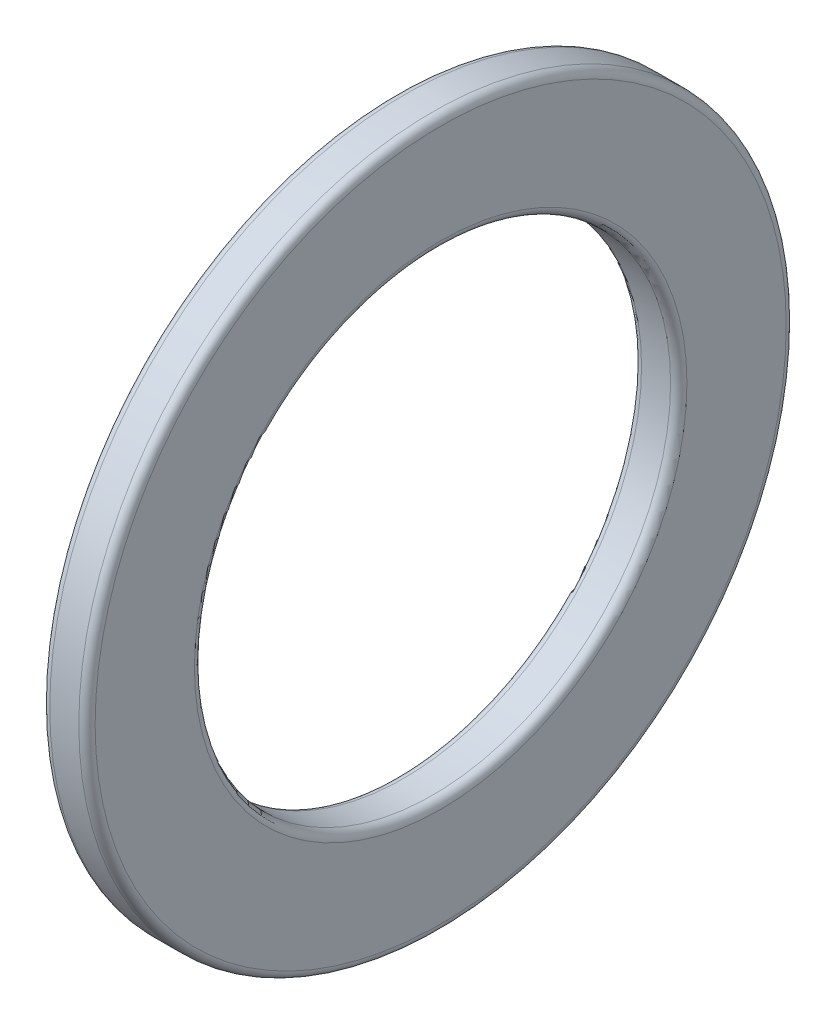
ISO-10303-21;
HEADER;
FILE_DESCRIPTION(('STEP AP214'),'2;1');
FILE_NAME('part.step','',(''),(''),'','','');
FILE_SCHEMA(('AUTOMOTIVE_DESIGN { 1 0 10303 214 1 1 1 1 }'));
ENDSEC;
DATA;
#1=APPLICATION_CONTEXT('core data for automotive mechanical design processes');
#2=APPLICATION_PROTOCOL_DEFINITION('international standard','automotive_design',2000,#1);
#3=PRODUCT_CONTEXT('',#1,'mechanical');
#4=PRODUCT('Part','Part','',(#3));
#5=PRODUCT_RELATED_PRODUCT_CATEGORY('part','',(#4));
#6=PRODUCT_DEFINITION_FORMATION('','',#4);
#7=PRODUCT_DEFINITION_CONTEXT('part definition',#1,'design');
#8=PRODUCT_DEFINITION('design','',#6,#7);
#9=PRODUCT_DEFINITION_SHAPE('','',#8);
#10=(LENGTH_UNIT() NAMED_UNIT(*) SI_UNIT(.MILLI.,.METRE.));
#11=(NAMED_UNIT(*) PLANE_ANGLE_UNIT() SI_UNIT($,.RADIAN.));
#12=(NAMED_UNIT(*) SI_UNIT($,.STERADIAN.) SOLID_ANGLE_UNIT());
#13=UNCERTAINTY_MEASURE_WITH_UNIT(LENGTH_MEASURE(1.E-05),#10,'distance_accuracy_value','');
#14=(GEOMETRIC_REPRESENTATION_CONTEXT(3) GLOBAL_UNCERTAINTY_ASSIGNED_CONTEXT((#13)) GLOBAL_UNIT_ASSIGNED_CONTEXT((#10,
#11,#12)) REPRESENTATION_CONTEXT('',''));
#15=CARTESIAN_POINT('',(0.,0.,0.));
#16=DIRECTION('',(0.,0.,1.));
#17=DIRECTION('',(1.,0.,0.));
#18=AXIS2_PLACEMENT_3D('',#15,#16,#17);
#19=CARTESIAN_POINT('',(-2.66666666666855,0.,0.));
#20=DIRECTION('',(1.,0.,0.));
#21=DIRECTION('',(0.,0.,-1.));
#22=AXIS2_PLACEMENT_3D('',#19,#20,#21);
#23=TOROIDAL_SURFACE('',#22,22.25,3.00000000000188);
#24=CARTESIAN_POINT('',(0.,0.,0.));
#25=DIRECTION('',(1.,0.,0.));
#26=DIRECTION('',(0.,0.,-1.));
#27=AXIS2_PLACEMENT_3D('',#24,#25,#26);
#28=CIRCLE('',#27,20.875631458127);
#29=CARTESIAN_POINT('',(0.,0.,-20.875631458127));
#30=VERTEX_POINT('',#29);
#31=EDGE_CURVE('E144',#30,#30,#28,.F.);
#32=ORIENTED_EDGE('',*,*,#31,.F.);
#33=EDGE_LOOP('',(#32));
#34=FACE_BOUND('',#33,.T.);
#35=CARTESIAN_POINT('',(0.,0.,0.));
#36=DIRECTION('',(1.,0.,0.));
#37=DIRECTION('',(0.,0.,-1.));
#38=AXIS2_PLACEMENT_3D('',#35,#36,#37);
#39=CIRCLE('',#38,23.624368541873);
#40=CARTESIAN_POINT('',(0.,0.,-23.624368541873));
#41=VERTEX_POINT('',#40);
#42=EDGE_CURVE('E19',#41,#41,#39,.T.);
#43=ORIENTED_EDGE('',*,*,#42,.F.);
#44=EDGE_LOOP('',(#43));
#45=FACE_BOUND('',#44,.T.);
#46=ADVANCED_FACE('F15',(#34,#45),#23,.F.);
#47=CARTESIAN_POINT('',(0.,25.4,0.));
#48=DIRECTION('',(-1.,0.,0.));
#49=DIRECTION('',(0.,0.,1.));
#50=AXIS2_PLACEMENT_3D('',#47,#48,#49);
#51=PLANE('',#50);
#52=ORIENTED_EDGE('',*,*,#42,.T.);
#53=EDGE_LOOP('',(#52));
#54=FACE_BOUND('',#53,.T.);
#55=CARTESIAN_POINT('',(0.,0.,0.));
#56=DIRECTION('',(1.,0.,0.));
#57=DIRECTION('',(0.,0.,1.));
#58=AXIS2_PLACEMENT_3D('',#55,#56,#57);
#59=CIRCLE('',#58,25.4);
#60=CARTESIAN_POINT('',(0.,0.,25.4));
#61=VERTEX_POINT('',#60);
#62=EDGE_CURVE('E116',#61,#61,#59,.T.);
#63=ORIENTED_EDGE('',*,*,#62,.F.);
#64=EDGE_LOOP('',(#63));
#65=FACE_BOUND('',#64,.T.);
#66=ADVANCED_FACE('F121',(#54,#65),#51,.T.);
#67=CARTESIAN_POINT('',(0.,20.875631458127,0.));
#68=DIRECTION('',(-1.,0.,0.));
#69=DIRECTION('',(0.,0.,1.));
#70=AXIS2_PLACEMENT_3D('',#67,#68,#69);
#71=PLANE('',#70);
#72=CARTESIAN_POINT('',(0.,0.,0.));
#73=DIRECTION('',(-1.,0.,0.));
#74=DIRECTION('',(0.,0.,1.));
#75=AXIS2_PLACEMENT_3D('',#72,#73,#74);
#76=CIRCLE('',#75,18.1);
#77=CARTESIAN_POINT('',(0.,0.,18.1));
#78=VERTEX_POINT('',#77);
#79=EDGE_CURVE('E85',#78,#78,#76,.T.);
#80=ORIENTED_EDGE('',*,*,#79,.F.);
#81=EDGE_LOOP('',(#80));
#82=FACE_BOUND('',#81,.T.);
#83=ORIENTED_EDGE('',*,*,#31,.T.);
#84=EDGE_LOOP('',(#83));
#85=FACE_BOUND('',#84,.T.);
#86=ADVANCED_FACE('F129',(#82,#85),#71,.T.);
#87=CARTESIAN_POINT('',(0.599999999999873,0.,0.));
#88=DIRECTION('',(1.,0.,0.));
#89=DIRECTION('',(0.,0.,-1.));
#90=AXIS2_PLACEMENT_3D('',#87,#88,#89);
#91=TOROIDAL_SURFACE('',#90,25.4000000000001,0.599999999999872);
#92=ORIENTED_EDGE('',*,*,#62,.T.);
#93=EDGE_LOOP('',(#92));
#94=FACE_BOUND('',#93,.T.);
#95=CARTESIAN_POINT('',(0.6,0.,0.));
#96=DIRECTION('',(1.,0.,0.));
#97=DIRECTION('',(0.,0.,-1.));
#98=AXIS2_PLACEMENT_3D('',#95,#96,#97);
#99=CIRCLE('',#98,26.);
#100=CARTESIAN_POINT('',(0.6,0.,-26.));
#101=VERTEX_POINT('',#100);
#102=EDGE_CURVE('E82',#101,#101,#99,.T.);
#103=ORIENTED_EDGE('',*,*,#102,.F.);
#104=EDGE_LOOP('',(#103));
#105=FACE_BOUND('',#104,.T.);
#106=ADVANCED_FACE('F96',(#94,#105),#91,.T.);
#107=CARTESIAN_POINT('',(0.599999999999875,0.,0.));
#108=DIRECTION('',(1.,0.,0.));
#109=DIRECTION('',(0.,0.,-1.));
#110=AXIS2_PLACEMENT_3D('',#107,#108,#109);
#111=TOROIDAL_SURFACE('',#110,18.0999999999999,0.599999999999875);
#112=CARTESIAN_POINT('',(0.6,0.,0.));
#113=DIRECTION('',(1.,0.,0.));
#114=DIRECTION('',(0.,0.,-1.));
#115=AXIS2_PLACEMENT_3D('',#112,#113,#114);
#116=CIRCLE('',#115,17.5);
#117=CARTESIAN_POINT('',(0.6,0.,-17.5));
#118=VERTEX_POINT('',#117);
#119=EDGE_CURVE('E38',#118,#118,#116,.T.);
#120=ORIENTED_EDGE('',*,*,#119,.T.);
#121=EDGE_LOOP('',(#120));
#122=FACE_BOUND('',#121,.T.);
#123=ORIENTED_EDGE('',*,*,#79,.T.);
#124=EDGE_LOOP('',(#123));
#125=FACE_BOUND('',#124,.T.);
#126=ADVANCED_FACE('F91',(#122,#125),#111,.T.);
#127=CARTESIAN_POINT('',(1.66666666666665,0.,0.));
#128=DIRECTION('',(1.,0.,0.));
#129=DIRECTION('',(0.,0.,-1.));
#130=AXIS2_PLACEMENT_3D('',#127,#128,#129);
#131=CYLINDRICAL_SURFACE('',#130,26.);
#132=ORIENTED_EDGE('',*,*,#102,.T.);
#133=EDGE_LOOP('',(#132));
#134=FACE_BOUND('',#133,.T.);
#135=CARTESIAN_POINT('',(2.73333333333355,0.,0.));
#136=DIRECTION('',(1.,0.,0.));
#137=DIRECTION('',(0.,0.,-1.));
#138=AXIS2_PLACEMENT_3D('',#135,#136,#137);
#139=CIRCLE('',#138,26.);
#140=CARTESIAN_POINT('',(2.73333333333355,0.,-26.));
#141=VERTEX_POINT('',#140);
#142=EDGE_CURVE('E33',#141,#141,#139,.T.);
#143=ORIENTED_EDGE('',*,*,#142,.F.);
#144=EDGE_LOOP('',(#143));
#145=FACE_BOUND('',#144,.T.);
#146=ADVANCED_FACE('F95',(#134,#145),#131,.T.);
#147=CARTESIAN_POINT('',(1.66666666666665,0.,0.));
#148=DIRECTION('',(1.,0.,0.));
#149=DIRECTION('',(0.,0.,-1.));
#150=AXIS2_PLACEMENT_3D('',#147,#148,#149);
#151=CYLINDRICAL_SURFACE('',#150,17.5);
#152=CARTESIAN_POINT('',(2.7333333333333,0.,0.));
#153=DIRECTION('',(1.,0.,0.));
#154=DIRECTION('',(0.,0.,-1.));
#155=AXIS2_PLACEMENT_3D('',#152,#153,#154);
#156=CIRCLE('',#155,17.5);
#157=CARTESIAN_POINT('',(2.7333333333333,0.,-17.5));
#158=VERTEX_POINT('',#157);
#159=EDGE_CURVE('E28',#158,#158,#156,.F.);
#160=ORIENTED_EDGE('',*,*,#159,.F.);
#161=EDGE_LOOP('',(#160));
#162=FACE_BOUND('',#161,.T.);
#163=ORIENTED_EDGE('',*,*,#119,.F.);
#164=EDGE_LOOP('',(#163));
#165=FACE_BOUND('',#164,.T.);
#166=ADVANCED_FACE('F67',(#162,#165),#151,.F.);
#167=CARTESIAN_POINT('',(2.73333333333355,0.,0.));
#168=DIRECTION('',(1.,0.,0.));
#169=DIRECTION('',(0.,0.,-1.));
#170=AXIS2_PLACEMENT_3D('',#167,#168,#169);
#171=TOROIDAL_SURFACE('',#170,25.4000000000002,0.599999999999754);
#172=ORIENTED_EDGE('',*,*,#142,.T.);
#173=EDGE_LOOP('',(#172));
#174=FACE_BOUND('',#173,.T.);
#175=CARTESIAN_POINT('',(3.3333333333333,0.,0.));
#176=DIRECTION('',(-1.,0.,0.));
#177=DIRECTION('',(0.,0.,1.));
#178=AXIS2_PLACEMENT_3D('',#175,#176,#177);
#179=CIRCLE('',#178,25.4);
#180=CARTESIAN_POINT('',(3.3333333333333,0.,25.4));
#181=VERTEX_POINT('',#180);
#182=EDGE_CURVE('E23',#181,#181,#179,.F.);
#183=ORIENTED_EDGE('',*,*,#182,.F.);
#184=EDGE_LOOP('',(#183));
#185=FACE_BOUND('',#184,.T.);
#186=ADVANCED_FACE('F62',(#174,#185),#171,.T.);
#187=CARTESIAN_POINT('',(2.73333333333355,0.,0.));
#188=DIRECTION('',(1.,0.,0.));
#189=DIRECTION('',(0.,0.,-1.));
#190=AXIS2_PLACEMENT_3D('',#187,#188,#189);
#191=TOROIDAL_SURFACE('',#190,18.0999999999998,0.599999999999756);
#192=CARTESIAN_POINT('',(3.33333333333331,0.,0.));
#193=DIRECTION('',(1.,0.,0.));
#194=DIRECTION('',(0.,0.,1.));
#195=AXIS2_PLACEMENT_3D('',#192,#193,#194);
#196=CIRCLE('',#195,18.1);
#197=CARTESIAN_POINT('',(3.33333333333331,0.,18.1));
#198=VERTEX_POINT('',#197);
#199=EDGE_CURVE('E10',#198,#198,#196,.F.);
#200=ORIENTED_EDGE('',*,*,#199,.F.);
#201=EDGE_LOOP('',(#200));
#202=FACE_BOUND('',#201,.T.);
#203=ORIENTED_EDGE('',*,*,#159,.T.);
#204=EDGE_LOOP('',(#203));
#205=FACE_BOUND('',#204,.T.);
#206=ADVANCED_FACE('F51',(#202,#205),#191,.T.);
#207=CARTESIAN_POINT('',(3.3333333333333,18.1,0.));
#208=DIRECTION('',(1.,0.,0.));
#209=DIRECTION('',(0.,0.,-1.));
#210=AXIS2_PLACEMENT_3D('',#207,#208,#209);
#211=PLANE('',#210);
#212=ORIENTED_EDGE('',*,*,#199,.T.);
#213=EDGE_LOOP('',(#212));
#214=FACE_BOUND('',#213,.T.);
#215=ORIENTED_EDGE('',*,*,#182,.T.);
#216=EDGE_LOOP('',(#215));
#217=FACE_BOUND('',#216,.T.);
#218=ADVANCED_FACE('F61',(#214,#217),#211,.T.);
#219=CLOSED_SHELL('',(#46,#66,#86,#106,#126,#146,#166,#186,#206,#218));
#220=MANIFOLD_SOLID_BREP('B1',#219);
#221=ADVANCED_BREP_SHAPE_REPRESENTATION('',(#18,#220),#14);
#222=SHAPE_DEFINITION_REPRESENTATION(#9,#221);
ENDSEC;
END-ISO-10303-21;
